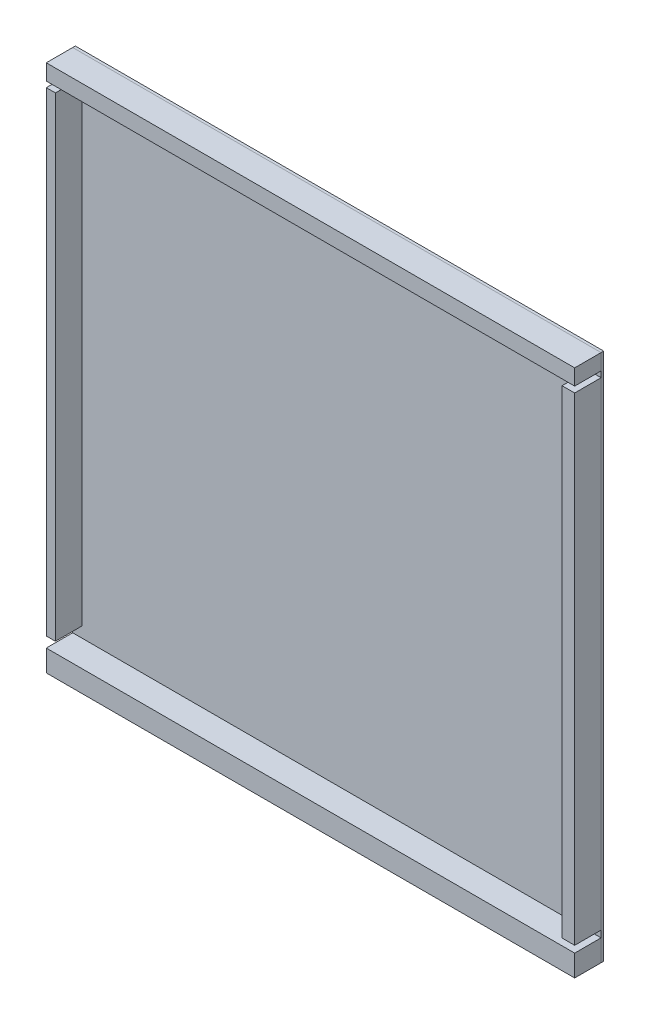
ISO-10303-21;
HEADER;
FILE_DESCRIPTION(('STEP AP214'),'2;1');
FILE_NAME('part.step','',(''),(''),'','','');
FILE_SCHEMA(('AUTOMOTIVE_DESIGN { 1 0 10303 214 1 1 1 1 }'));
ENDSEC;
DATA;
#1=APPLICATION_CONTEXT('core data for automotive mechanical design processes');
#2=APPLICATION_PROTOCOL_DEFINITION('international standard','automotive_design',2000,#1);
#3=PRODUCT_CONTEXT('',#1,'mechanical');
#4=PRODUCT('Part','Part','',(#3));
#5=PRODUCT_RELATED_PRODUCT_CATEGORY('part','',(#4));
#6=PRODUCT_DEFINITION_FORMATION('','',#4);
#7=PRODUCT_DEFINITION_CONTEXT('part definition',#1,'design');
#8=PRODUCT_DEFINITION('design','',#6,#7);
#9=PRODUCT_DEFINITION_SHAPE('','',#8);
#10=(LENGTH_UNIT() NAMED_UNIT(*) SI_UNIT(.MILLI.,.METRE.));
#11=(NAMED_UNIT(*) PLANE_ANGLE_UNIT() SI_UNIT($,.RADIAN.));
#12=(NAMED_UNIT(*) SI_UNIT($,.STERADIAN.) SOLID_ANGLE_UNIT());
#13=UNCERTAINTY_MEASURE_WITH_UNIT(LENGTH_MEASURE(1.E-05),#10,'distance_accuracy_value','');
#14=(GEOMETRIC_REPRESENTATION_CONTEXT(3) GLOBAL_UNCERTAINTY_ASSIGNED_CONTEXT((#13)) GLOBAL_UNIT_ASSIGNED_CONTEXT((#10,
#11,#12)) REPRESENTATION_CONTEXT('',''));
#15=CARTESIAN_POINT('',(0.,0.,0.));
#16=DIRECTION('',(0.,0.,1.));
#17=DIRECTION('',(1.,0.,0.));
#18=AXIS2_PLACEMENT_3D('',#15,#16,#17);
#19=CARTESIAN_POINT('',(-250.,1668.54906036764,110.));
#20=DIRECTION('',(1.,0.,0.));
#21=DIRECTION('',(0.,0.,-1.));
#22=AXIS2_PLACEMENT_3D('',#19,#20,#21);
#23=PLANE('',#22);
#24=DIRECTION('',(0.,-1.,0.));
#25=VECTOR('',#24,1.);
#26=CARTESIAN_POINT('',(-250.,1668.54906036764,10.));
#27=LINE('',#26,#25);
#28=CARTESIAN_POINT('',(-250.,1668.54906036764,10.));
#29=VERTEX_POINT('',#28);
#30=CARTESIAN_POINT('',(-250.,-128.991405169124,10.));
#31=VERTEX_POINT('',#30);
#32=EDGE_CURVE('E115',#29,#31,#27,.T.);
#33=ORIENTED_EDGE('',*,*,#32,.T.);
#34=DIRECTION('',(0.,0.,-1.));
#35=VECTOR('',#34,1.);
#36=CARTESIAN_POINT('',(-250.,-128.991405169124,110.));
#37=LINE('',#36,#35);
#38=CARTESIAN_POINT('',(-250.,-128.991405169124,110.));
#39=VERTEX_POINT('',#38);
#40=EDGE_CURVE('E12',#39,#31,#37,.T.);
#41=ORIENTED_EDGE('',*,*,#40,.F.);
#42=DIRECTION('',(0.,-1.,0.));
#43=VECTOR('',#42,1.);
#44=CARTESIAN_POINT('',(-250.,1668.54906036764,110.));
#45=LINE('',#44,#43);
#46=CARTESIAN_POINT('',(-250.,1668.54906036764,110.));
#47=VERTEX_POINT('',#46);
#48=EDGE_CURVE('E103',#47,#39,#45,.T.);
#49=ORIENTED_EDGE('',*,*,#48,.F.);
#50=DIRECTION('',(0.,0.,-1.));
#51=VECTOR('',#50,1.);
#52=CARTESIAN_POINT('',(-250.,1668.54906036764,110.));
#53=LINE('',#52,#51);
#54=EDGE_CURVE('E111',#47,#29,#53,.T.);
#55=ORIENTED_EDGE('',*,*,#54,.T.);
#56=EDGE_LOOP('',(#33,#41,#49,#55));
#57=FACE_BOUND('',#56,.T.);
#58=ADVANCED_FACE('F52',(#57),#23,.F.);
#59=CARTESIAN_POINT('',(-250.,-128.991405169124,110.));
#60=DIRECTION('',(0.,1.,0.));
#61=DIRECTION('',(0.,0.,1.));
#62=AXIS2_PLACEMENT_3D('',#59,#60,#61);
#63=PLANE('',#62);
#64=DIRECTION('',(1.,0.,0.));
#65=VECTOR('',#64,1.);
#66=CARTESIAN_POINT('',(-250.,-128.991405169124,10.));
#67=LINE('',#66,#65);
#68=CARTESIAN_POINT('',(-215.357816950501,-128.991405169124,10.));
#69=VERTEX_POINT('',#68);
#70=EDGE_CURVE('E107',#31,#69,#67,.T.);
#71=ORIENTED_EDGE('',*,*,#70,.T.);
#72=DIRECTION('',(0.,0.,-1.));
#73=VECTOR('',#72,1.);
#74=CARTESIAN_POINT('',(-215.357816950501,-128.991405169124,110.));
#75=LINE('',#74,#73);
#76=CARTESIAN_POINT('',(-215.357816950501,-128.991405169124,110.));
#77=VERTEX_POINT('',#76);
#78=EDGE_CURVE('E60',#77,#69,#75,.T.);
#79=ORIENTED_EDGE('',*,*,#78,.F.);
#80=DIRECTION('',(1.,0.,0.));
#81=VECTOR('',#80,1.);
#82=CARTESIAN_POINT('',(-250.,-128.991405169124,110.));
#83=LINE('',#82,#81);
#84=EDGE_CURVE('E98',#39,#77,#83,.T.);
#85=ORIENTED_EDGE('',*,*,#84,.F.);
#86=ORIENTED_EDGE('',*,*,#40,.T.);
#87=EDGE_LOOP('',(#71,#79,#85,#86));
#88=FACE_BOUND('',#87,.T.);
#89=ADVANCED_FACE('F106',(#88),#63,.F.);
#90=CARTESIAN_POINT('',(-215.357816950501,1668.54906036764,110.));
#91=DIRECTION('',(-1.,0.,0.));
#92=DIRECTION('',(0.,0.,1.));
#93=AXIS2_PLACEMENT_3D('',#90,#91,#92);
#94=PLANE('',#93);
#95=DIRECTION('',(0.,1.,0.));
#96=VECTOR('',#95,1.);
#97=CARTESIAN_POINT('',(-215.357816950501,1668.54906036764,10.));
#98=LINE('',#97,#96);
#99=CARTESIAN_POINT('',(-215.357816950501,1668.54906036764,10.));
#100=VERTEX_POINT('',#99);
#101=EDGE_CURVE('E85',#69,#100,#98,.T.);
#102=ORIENTED_EDGE('',*,*,#101,.T.);
#103=DIRECTION('',(0.,0.,-1.));
#104=VECTOR('',#103,1.);
#105=CARTESIAN_POINT('',(-215.357816950501,1668.54906036764,110.));
#106=LINE('',#105,#104);
#107=CARTESIAN_POINT('',(-215.357816950501,1668.54906036764,110.));
#108=VERTEX_POINT('',#107);
#109=EDGE_CURVE('E108',#108,#100,#106,.T.);
#110=ORIENTED_EDGE('',*,*,#109,.F.);
#111=DIRECTION('',(0.,1.,0.));
#112=VECTOR('',#111,1.);
#113=CARTESIAN_POINT('',(-215.357816950501,1668.54906036764,110.));
#114=LINE('',#113,#112);
#115=EDGE_CURVE('E101',#77,#108,#114,.T.);
#116=ORIENTED_EDGE('',*,*,#115,.F.);
#117=ORIENTED_EDGE('',*,*,#78,.T.);
#118=EDGE_LOOP('',(#102,#110,#116,#117));
#119=FACE_BOUND('',#118,.T.);
#120=ADVANCED_FACE('F109',(#119),#94,.F.);
#121=CARTESIAN_POINT('',(-250.,1668.54906036764,110.));
#122=DIRECTION('',(0.,-1.,0.));
#123=DIRECTION('',(0.,0.,-1.));
#124=AXIS2_PLACEMENT_3D('',#121,#122,#123);
#125=PLANE('',#124);
#126=DIRECTION('',(-1.,0.,0.));
#127=VECTOR('',#126,1.);
#128=CARTESIAN_POINT('',(-250.,1668.54906036764,10.));
#129=LINE('',#128,#127);
#130=EDGE_CURVE('E91',#100,#29,#129,.T.);
#131=ORIENTED_EDGE('',*,*,#130,.T.);
#132=ORIENTED_EDGE('',*,*,#54,.F.);
#133=DIRECTION('',(-1.,0.,0.));
#134=VECTOR('',#133,1.);
#135=CARTESIAN_POINT('',(-250.,1668.54906036764,110.));
#136=LINE('',#135,#134);
#137=EDGE_CURVE('E68',#108,#47,#136,.T.);
#138=ORIENTED_EDGE('',*,*,#137,.F.);
#139=ORIENTED_EDGE('',*,*,#109,.T.);
#140=EDGE_LOOP('',(#131,#132,#138,#139));
#141=FACE_BOUND('',#140,.T.);
#142=ADVANCED_FACE('F122',(#141),#125,.F.);
#143=CARTESIAN_POINT('',(0.,0.,110.));
#144=DIRECTION('',(0.,0.,1.));
#145=DIRECTION('',(1.,0.,0.));
#146=AXIS2_PLACEMENT_3D('',#143,#144,#145);
#147=PLANE('',#146);
#148=ORIENTED_EDGE('',*,*,#48,.T.);
#149=ORIENTED_EDGE('',*,*,#84,.T.);
#150=ORIENTED_EDGE('',*,*,#115,.T.);
#151=ORIENTED_EDGE('',*,*,#137,.T.);
#152=EDGE_LOOP('',(#148,#149,#150,#151));
#153=FACE_BOUND('',#152,.T.);
#154=ADVANCED_FACE('F99',(#153),#147,.T.);
#155=CARTESIAN_POINT('',(0.,0.,10.));
#156=DIRECTION('',(0.,0.,1.));
#157=DIRECTION('',(1.,0.,0.));
#158=AXIS2_PLACEMENT_3D('',#155,#156,#157);
#159=PLANE('',#158);
#160=ORIENTED_EDGE('',*,*,#32,.F.);
#161=ORIENTED_EDGE('',*,*,#130,.F.);
#162=ORIENTED_EDGE('',*,*,#101,.F.);
#163=ORIENTED_EDGE('',*,*,#70,.F.);
#164=EDGE_LOOP('',(#160,#161,#162,#163));
#165=FACE_BOUND('',#164,.T.);
#166=ADVANCED_FACE('F125',(#165),#159,.F.);
#167=CLOSED_SHELL('',(#58,#89,#120,#142,#154,#166));
#168=MANIFOLD_SOLID_BREP('B2',#167);
#169=CARTESIAN_POINT('',(1750.,1667.61508225097,110.));
#170=DIRECTION('',(-1.,0.,0.));
#171=DIRECTION('',(0.,0.,1.));
#172=AXIS2_PLACEMENT_3D('',#169,#170,#171);
#173=PLANE('',#172);
#174=DIRECTION('',(0.,1.,0.));
#175=VECTOR('',#174,1.);
#176=CARTESIAN_POINT('',(1750.,1667.61508225097,10.));
#177=LINE('',#176,#175);
#178=CARTESIAN_POINT('',(1750.,-142.873459851821,10.));
#179=VERTEX_POINT('',#178);
#180=CARTESIAN_POINT('',(1750.,1667.61508225097,10.));
#181=VERTEX_POINT('',#180);
#182=EDGE_CURVE('E249',#179,#181,#177,.T.);
#183=ORIENTED_EDGE('',*,*,#182,.T.);
#184=DIRECTION('',(0.,0.,-1.));
#185=VECTOR('',#184,1.);
#186=CARTESIAN_POINT('',(1750.,1667.61508225097,110.));
#187=LINE('',#186,#185);
#188=CARTESIAN_POINT('',(1750.,1667.61508225097,110.));
#189=VERTEX_POINT('',#188);
#190=EDGE_CURVE('E50',#189,#181,#187,.T.);
#191=ORIENTED_EDGE('',*,*,#190,.F.);
#192=DIRECTION('',(0.,1.,0.));
#193=VECTOR('',#192,1.);
#194=CARTESIAN_POINT('',(1750.,1667.61508225097,110.));
#195=LINE('',#194,#193);
#196=CARTESIAN_POINT('',(1750.,-142.873459851821,110.));
#197=VERTEX_POINT('',#196);
#198=EDGE_CURVE('E237',#197,#189,#195,.T.);
#199=ORIENTED_EDGE('',*,*,#198,.F.);
#200=DIRECTION('',(0.,0.,-1.));
#201=VECTOR('',#200,1.);
#202=CARTESIAN_POINT('',(1750.,-142.873459851821,110.));
#203=LINE('',#202,#201);
#204=EDGE_CURVE('E245',#197,#179,#203,.T.);
#205=ORIENTED_EDGE('',*,*,#204,.T.);
#206=EDGE_LOOP('',(#183,#191,#199,#205));
#207=FACE_BOUND('',#206,.T.);
#208=ADVANCED_FACE('F186',(#207),#173,.F.);
#209=CARTESIAN_POINT('',(1750.,1667.61508225097,110.));
#210=DIRECTION('',(0.,-1.,0.));
#211=DIRECTION('',(0.,0.,-1.));
#212=AXIS2_PLACEMENT_3D('',#209,#210,#211);
#213=PLANE('',#212);
#214=DIRECTION('',(-1.,0.,0.));
#215=VECTOR('',#214,1.);
#216=CARTESIAN_POINT('',(1750.,1667.61508225097,10.));
#217=LINE('',#216,#215);
#218=CARTESIAN_POINT('',(1702.26568186651,1667.61508225097,10.));
#219=VERTEX_POINT('',#218);
#220=EDGE_CURVE('E241',#181,#219,#217,.T.);
#221=ORIENTED_EDGE('',*,*,#220,.T.);
#222=DIRECTION('',(0.,0.,-1.));
#223=VECTOR('',#222,1.);
#224=CARTESIAN_POINT('',(1702.26568186651,1667.61508225097,110.));
#225=LINE('',#224,#223);
#226=CARTESIAN_POINT('',(1702.26568186651,1667.61508225097,110.));
#227=VERTEX_POINT('',#226);
#228=EDGE_CURVE('E194',#227,#219,#225,.T.);
#229=ORIENTED_EDGE('',*,*,#228,.F.);
#230=DIRECTION('',(-1.,0.,0.));
#231=VECTOR('',#230,1.);
#232=CARTESIAN_POINT('',(1750.,1667.61508225097,110.));
#233=LINE('',#232,#231);
#234=EDGE_CURVE('E232',#189,#227,#233,.T.);
#235=ORIENTED_EDGE('',*,*,#234,.F.);
#236=ORIENTED_EDGE('',*,*,#190,.T.);
#237=EDGE_LOOP('',(#221,#229,#235,#236));
#238=FACE_BOUND('',#237,.T.);
#239=ADVANCED_FACE('F240',(#238),#213,.F.);
#240=CARTESIAN_POINT('',(1702.26568186651,1667.61508225097,110.));
#241=DIRECTION('',(1.,0.,0.));
#242=DIRECTION('',(0.,1.,0.));
#243=AXIS2_PLACEMENT_3D('',#240,#241,#242);
#244=PLANE('',#243);
#245=DIRECTION('',(0.,-1.,0.));
#246=VECTOR('',#245,1.);
#247=CARTESIAN_POINT('',(1702.26568186651,1667.61508225097,10.));
#248=LINE('',#247,#246);
#249=CARTESIAN_POINT('',(1702.26568186651,-142.873459851821,10.));
#250=VERTEX_POINT('',#249);
#251=EDGE_CURVE('E219',#219,#250,#248,.T.);
#252=ORIENTED_EDGE('',*,*,#251,.T.);
#253=DIRECTION('',(0.,0.,-1.));
#254=VECTOR('',#253,1.);
#255=CARTESIAN_POINT('',(1702.26568186651,-142.873459851821,110.));
#256=LINE('',#255,#254);
#257=CARTESIAN_POINT('',(1702.26568186651,-142.873459851821,110.));
#258=VERTEX_POINT('',#257);
#259=EDGE_CURVE('E242',#258,#250,#256,.T.);
#260=ORIENTED_EDGE('',*,*,#259,.F.);
#261=DIRECTION('',(0.,-1.,0.));
#262=VECTOR('',#261,1.);
#263=CARTESIAN_POINT('',(1702.26568186651,1667.61508225097,110.));
#264=LINE('',#263,#262);
#265=EDGE_CURVE('E235',#227,#258,#264,.T.);
#266=ORIENTED_EDGE('',*,*,#265,.F.);
#267=ORIENTED_EDGE('',*,*,#228,.T.);
#268=EDGE_LOOP('',(#252,#260,#266,#267));
#269=FACE_BOUND('',#268,.T.);
#270=ADVANCED_FACE('F243',(#269),#244,.F.);
#271=CARTESIAN_POINT('',(1750.,-142.873459851821,110.));
#272=DIRECTION('',(0.,1.,0.));
#273=DIRECTION('',(0.,0.,1.));
#274=AXIS2_PLACEMENT_3D('',#271,#272,#273);
#275=PLANE('',#274);
#276=DIRECTION('',(1.,0.,0.));
#277=VECTOR('',#276,1.);
#278=CARTESIAN_POINT('',(1750.,-142.873459851821,10.));
#279=LINE('',#278,#277);
#280=EDGE_CURVE('E225',#250,#179,#279,.T.);
#281=ORIENTED_EDGE('',*,*,#280,.T.);
#282=ORIENTED_EDGE('',*,*,#204,.F.);
#283=DIRECTION('',(1.,0.,0.));
#284=VECTOR('',#283,1.);
#285=CARTESIAN_POINT('',(1750.,-142.873459851821,110.));
#286=LINE('',#285,#284);
#287=EDGE_CURVE('E202',#258,#197,#286,.T.);
#288=ORIENTED_EDGE('',*,*,#287,.F.);
#289=ORIENTED_EDGE('',*,*,#259,.T.);
#290=EDGE_LOOP('',(#281,#282,#288,#289));
#291=FACE_BOUND('',#290,.T.);
#292=ADVANCED_FACE('F256',(#291),#275,.F.);
#293=CARTESIAN_POINT('',(0.,0.,110.));
#294=DIRECTION('',(0.,0.,-1.));
#295=DIRECTION('',(-1.,0.,0.));
#296=AXIS2_PLACEMENT_3D('',#293,#294,#295);
#297=PLANE('',#296);
#298=ORIENTED_EDGE('',*,*,#198,.T.);
#299=ORIENTED_EDGE('',*,*,#234,.T.);
#300=ORIENTED_EDGE('',*,*,#265,.T.);
#301=ORIENTED_EDGE('',*,*,#287,.T.);
#302=EDGE_LOOP('',(#298,#299,#300,#301));
#303=FACE_BOUND('',#302,.T.);
#304=ADVANCED_FACE('F233',(#303),#297,.F.);
#305=CARTESIAN_POINT('',(0.,0.,10.));
#306=DIRECTION('',(0.,0.,-1.));
#307=DIRECTION('',(-1.,0.,0.));
#308=AXIS2_PLACEMENT_3D('',#305,#306,#307);
#309=PLANE('',#308);
#310=ORIENTED_EDGE('',*,*,#182,.F.);
#311=ORIENTED_EDGE('',*,*,#280,.F.);
#312=ORIENTED_EDGE('',*,*,#251,.F.);
#313=ORIENTED_EDGE('',*,*,#220,.F.);
#314=EDGE_LOOP('',(#310,#311,#312,#313));
#315=FACE_BOUND('',#314,.T.);
#316=ADVANCED_FACE('F259',(#315),#309,.T.);
#317=CLOSED_SHELL('',(#208,#239,#270,#292,#304,#316));
#318=MANIFOLD_SOLID_BREP('B6',#317);
#319=CARTESIAN_POINT('',(1750.,-250.,110.));
#320=DIRECTION('',(-1.,0.,0.));
#321=DIRECTION('',(0.,0.,1.));
#322=AXIS2_PLACEMENT_3D('',#319,#320,#321);
#323=PLANE('',#322);
#324=DIRECTION('',(0.,1.,0.));
#325=VECTOR('',#324,1.);
#326=CARTESIAN_POINT('',(1750.,-250.,10.));
#327=LINE('',#326,#325);
#328=CARTESIAN_POINT('',(1750.,-250.,10.));
#329=VERTEX_POINT('',#328);
#330=CARTESIAN_POINT('',(1750.,-168.414891018658,10.));
#331=VERTEX_POINT('',#330);
#332=EDGE_CURVE('E383',#329,#331,#327,.T.);
#333=ORIENTED_EDGE('',*,*,#332,.T.);
#334=DIRECTION('',(0.,0.,-1.));
#335=VECTOR('',#334,1.);
#336=CARTESIAN_POINT('',(1750.,-168.414891018658,110.));
#337=LINE('',#336,#335);
#338=CARTESIAN_POINT('',(1750.,-168.414891018658,110.));
#339=VERTEX_POINT('',#338);
#340=EDGE_CURVE('E184',#339,#331,#337,.T.);
#341=ORIENTED_EDGE('',*,*,#340,.F.);
#342=DIRECTION('',(0.,1.,0.));
#343=VECTOR('',#342,1.);
#344=CARTESIAN_POINT('',(1750.,-250.,110.));
#345=LINE('',#344,#343);
#346=CARTESIAN_POINT('',(1750.,-250.,110.));
#347=VERTEX_POINT('',#346);
#348=EDGE_CURVE('E371',#347,#339,#345,.T.);
#349=ORIENTED_EDGE('',*,*,#348,.F.);
#350=DIRECTION('',(0.,0.,-1.));
#351=VECTOR('',#350,1.);
#352=CARTESIAN_POINT('',(1750.,-250.,110.));
#353=LINE('',#352,#351);
#354=EDGE_CURVE('E379',#347,#329,#353,.T.);
#355=ORIENTED_EDGE('',*,*,#354,.T.);
#356=EDGE_LOOP('',(#333,#341,#349,#355));
#357=FACE_BOUND('',#356,.T.);
#358=ADVANCED_FACE('F320',(#357),#323,.F.);
#359=CARTESIAN_POINT('',(1750.,-168.414891018658,110.));
#360=DIRECTION('',(0.,-1.,0.));
#361=DIRECTION('',(1.,0.,0.));
#362=AXIS2_PLACEMENT_3D('',#359,#360,#361);
#363=PLANE('',#362);
#364=DIRECTION('',(-1.,0.,0.));
#365=VECTOR('',#364,1.);
#366=CARTESIAN_POINT('',(1750.,-168.414891018658,10.));
#367=LINE('',#366,#365);
#368=CARTESIAN_POINT('',(-250.,-168.414891018658,10.));
#369=VERTEX_POINT('',#368);
#370=EDGE_CURVE('E375',#331,#369,#367,.T.);
#371=ORIENTED_EDGE('',*,*,#370,.T.);
#372=DIRECTION('',(0.,0.,-1.));
#373=VECTOR('',#372,1.);
#374=CARTESIAN_POINT('',(-250.,-168.414891018658,110.));
#375=LINE('',#374,#373);
#376=CARTESIAN_POINT('',(-250.,-168.414891018658,110.));
#377=VERTEX_POINT('',#376);
#378=EDGE_CURVE('E328',#377,#369,#375,.T.);
#379=ORIENTED_EDGE('',*,*,#378,.F.);
#380=DIRECTION('',(-1.,0.,0.));
#381=VECTOR('',#380,1.);
#382=CARTESIAN_POINT('',(1750.,-168.414891018658,110.));
#383=LINE('',#382,#381);
#384=EDGE_CURVE('E366',#339,#377,#383,.T.);
#385=ORIENTED_EDGE('',*,*,#384,.F.);
#386=ORIENTED_EDGE('',*,*,#340,.T.);
#387=EDGE_LOOP('',(#371,#379,#385,#386));
#388=FACE_BOUND('',#387,.T.);
#389=ADVANCED_FACE('F374',(#388),#363,.F.);
#390=CARTESIAN_POINT('',(-250.,-250.,110.));
#391=DIRECTION('',(1.,0.,0.));
#392=DIRECTION('',(0.,1.,0.));
#393=AXIS2_PLACEMENT_3D('',#390,#391,#392);
#394=PLANE('',#393);
#395=DIRECTION('',(0.,-1.,0.));
#396=VECTOR('',#395,1.);
#397=CARTESIAN_POINT('',(-250.,-250.,10.));
#398=LINE('',#397,#396);
#399=CARTESIAN_POINT('',(-250.,-250.,10.));
#400=VERTEX_POINT('',#399);
#401=EDGE_CURVE('E353',#369,#400,#398,.T.);
#402=ORIENTED_EDGE('',*,*,#401,.T.);
#403=DIRECTION('',(0.,0.,-1.));
#404=VECTOR('',#403,1.);
#405=CARTESIAN_POINT('',(-250.,-250.,110.));
#406=LINE('',#405,#404);
#407=CARTESIAN_POINT('',(-250.,-250.,110.));
#408=VERTEX_POINT('',#407);
#409=EDGE_CURVE('E376',#408,#400,#406,.T.);
#410=ORIENTED_EDGE('',*,*,#409,.F.);
#411=DIRECTION('',(0.,-1.,0.));
#412=VECTOR('',#411,1.);
#413=CARTESIAN_POINT('',(-250.,-250.,110.));
#414=LINE('',#413,#412);
#415=EDGE_CURVE('E369',#377,#408,#414,.T.);
#416=ORIENTED_EDGE('',*,*,#415,.F.);
#417=ORIENTED_EDGE('',*,*,#378,.T.);
#418=EDGE_LOOP('',(#402,#410,#416,#417));
#419=FACE_BOUND('',#418,.T.);
#420=ADVANCED_FACE('F377',(#419),#394,.F.);
#421=CARTESIAN_POINT('',(1750.,-250.,110.));
#422=DIRECTION('',(0.,1.,0.));
#423=DIRECTION('',(-1.,0.,0.));
#424=AXIS2_PLACEMENT_3D('',#421,#422,#423);
#425=PLANE('',#424);
#426=DIRECTION('',(1.,0.,0.));
#427=VECTOR('',#426,1.);
#428=CARTESIAN_POINT('',(1750.,-250.,10.));
#429=LINE('',#428,#427);
#430=EDGE_CURVE('E359',#400,#329,#429,.T.);
#431=ORIENTED_EDGE('',*,*,#430,.T.);
#432=ORIENTED_EDGE('',*,*,#354,.F.);
#433=DIRECTION('',(1.,0.,0.));
#434=VECTOR('',#433,1.);
#435=CARTESIAN_POINT('',(1750.,-250.,110.));
#436=LINE('',#435,#434);
#437=EDGE_CURVE('E336',#408,#347,#436,.T.);
#438=ORIENTED_EDGE('',*,*,#437,.F.);
#439=ORIENTED_EDGE('',*,*,#409,.T.);
#440=EDGE_LOOP('',(#431,#432,#438,#439));
#441=FACE_BOUND('',#440,.T.);
#442=ADVANCED_FACE('F390',(#441),#425,.F.);
#443=CARTESIAN_POINT('',(0.,0.,110.));
#444=DIRECTION('',(0.,0.,1.));
#445=DIRECTION('',(1.,0.,0.));
#446=AXIS2_PLACEMENT_3D('',#443,#444,#445);
#447=PLANE('',#446);
#448=ORIENTED_EDGE('',*,*,#348,.T.);
#449=ORIENTED_EDGE('',*,*,#384,.T.);
#450=ORIENTED_EDGE('',*,*,#415,.T.);
#451=ORIENTED_EDGE('',*,*,#437,.T.);
#452=EDGE_LOOP('',(#448,#449,#450,#451));
#453=FACE_BOUND('',#452,.T.);
#454=ADVANCED_FACE('F367',(#453),#447,.T.);
#455=CARTESIAN_POINT('',(0.,0.,10.));
#456=DIRECTION('',(0.,0.,1.));
#457=DIRECTION('',(1.,0.,0.));
#458=AXIS2_PLACEMENT_3D('',#455,#456,#457);
#459=PLANE('',#458);
#460=ORIENTED_EDGE('',*,*,#332,.F.);
#461=ORIENTED_EDGE('',*,*,#430,.F.);
#462=ORIENTED_EDGE('',*,*,#401,.F.);
#463=ORIENTED_EDGE('',*,*,#370,.F.);
#464=EDGE_LOOP('',(#460,#461,#462,#463));
#465=FACE_BOUND('',#464,.T.);
#466=ADVANCED_FACE('F393',(#465),#459,.F.);
#467=CLOSED_SHELL('',(#358,#389,#420,#442,#454,#466));
#468=MANIFOLD_SOLID_BREP('B44',#467);
#469=CARTESIAN_POINT('',(-250.,1750.,110.));
#470=DIRECTION('',(1.,0.,0.));
#471=DIRECTION('',(0.,0.,-1.));
#472=AXIS2_PLACEMENT_3D('',#469,#470,#471);
#473=PLANE('',#472);
#474=DIRECTION('',(0.,-1.,0.));
#475=VECTOR('',#474,1.);
#476=CARTESIAN_POINT('',(-250.,1750.,10.));
#477=LINE('',#476,#475);
#478=CARTESIAN_POINT('',(-250.,1750.,10.));
#479=VERTEX_POINT('',#478);
#480=CARTESIAN_POINT('',(-250.,1690.1337543449,10.));
#481=VERTEX_POINT('',#480);
#482=EDGE_CURVE('E517',#479,#481,#477,.T.);
#483=ORIENTED_EDGE('',*,*,#482,.T.);
#484=DIRECTION('',(0.,0.,-1.));
#485=VECTOR('',#484,1.);
#486=CARTESIAN_POINT('',(-250.,1690.1337543449,110.));
#487=LINE('',#486,#485);
#488=CARTESIAN_POINT('',(-250.,1690.1337543449,110.));
#489=VERTEX_POINT('',#488);
#490=EDGE_CURVE('E318',#489,#481,#487,.T.);
#491=ORIENTED_EDGE('',*,*,#490,.F.);
#492=DIRECTION('',(0.,-1.,0.));
#493=VECTOR('',#492,1.);
#494=CARTESIAN_POINT('',(-250.,1750.,110.));
#495=LINE('',#494,#493);
#496=CARTESIAN_POINT('',(-250.,1750.,110.));
#497=VERTEX_POINT('',#496);
#498=EDGE_CURVE('E505',#497,#489,#495,.T.);
#499=ORIENTED_EDGE('',*,*,#498,.F.);
#500=DIRECTION('',(0.,0.,-1.));
#501=VECTOR('',#500,1.);
#502=CARTESIAN_POINT('',(-250.,1750.,110.));
#503=LINE('',#502,#501);
#504=EDGE_CURVE('E513',#497,#479,#503,.T.);
#505=ORIENTED_EDGE('',*,*,#504,.T.);
#506=EDGE_LOOP('',(#483,#491,#499,#505));
#507=FACE_BOUND('',#506,.T.);
#508=ADVANCED_FACE('F454',(#507),#473,.F.);
#509=CARTESIAN_POINT('',(-250.,1690.1337543449,110.));
#510=DIRECTION('',(0.,1.,0.));
#511=DIRECTION('',(0.,0.,1.));
#512=AXIS2_PLACEMENT_3D('',#509,#510,#511);
#513=PLANE('',#512);
#514=DIRECTION('',(1.,0.,0.));
#515=VECTOR('',#514,1.);
#516=CARTESIAN_POINT('',(-250.,1690.1337543449,10.));
#517=LINE('',#516,#515);
#518=CARTESIAN_POINT('',(1750.,1690.1337543449,10.));
#519=VERTEX_POINT('',#518);
#520=EDGE_CURVE('E509',#481,#519,#517,.T.);
#521=ORIENTED_EDGE('',*,*,#520,.T.);
#522=DIRECTION('',(0.,0.,-1.));
#523=VECTOR('',#522,1.);
#524=CARTESIAN_POINT('',(1750.,1690.1337543449,110.));
#525=LINE('',#524,#523);
#526=CARTESIAN_POINT('',(1750.,1690.1337543449,110.));
#527=VERTEX_POINT('',#526);
#528=EDGE_CURVE('E462',#527,#519,#525,.T.);
#529=ORIENTED_EDGE('',*,*,#528,.F.);
#530=DIRECTION('',(1.,0.,0.));
#531=VECTOR('',#530,1.);
#532=CARTESIAN_POINT('',(-250.,1690.1337543449,110.));
#533=LINE('',#532,#531);
#534=EDGE_CURVE('E500',#489,#527,#533,.T.);
#535=ORIENTED_EDGE('',*,*,#534,.F.);
#536=ORIENTED_EDGE('',*,*,#490,.T.);
#537=EDGE_LOOP('',(#521,#529,#535,#536));
#538=FACE_BOUND('',#537,.T.);
#539=ADVANCED_FACE('F508',(#538),#513,.F.);
#540=CARTESIAN_POINT('',(1750.,1750.,110.));
#541=DIRECTION('',(-1.,0.,0.));
#542=DIRECTION('',(0.,-1.,0.));
#543=AXIS2_PLACEMENT_3D('',#540,#541,#542);
#544=PLANE('',#543);
#545=DIRECTION('',(0.,1.,0.));
#546=VECTOR('',#545,1.);
#547=CARTESIAN_POINT('',(1750.,1750.,10.));
#548=LINE('',#547,#546);
#549=CARTESIAN_POINT('',(1750.,1750.,10.));
#550=VERTEX_POINT('',#549);
#551=EDGE_CURVE('E487',#519,#550,#548,.T.);
#552=ORIENTED_EDGE('',*,*,#551,.T.);
#553=DIRECTION('',(0.,0.,-1.));
#554=VECTOR('',#553,1.);
#555=CARTESIAN_POINT('',(1750.,1750.,110.));
#556=LINE('',#555,#554);
#557=CARTESIAN_POINT('',(1750.,1750.,110.));
#558=VERTEX_POINT('',#557);
#559=EDGE_CURVE('E510',#558,#550,#556,.T.);
#560=ORIENTED_EDGE('',*,*,#559,.F.);
#561=DIRECTION('',(0.,1.,0.));
#562=VECTOR('',#561,1.);
#563=CARTESIAN_POINT('',(1750.,1750.,110.));
#564=LINE('',#563,#562);
#565=EDGE_CURVE('E503',#527,#558,#564,.T.);
#566=ORIENTED_EDGE('',*,*,#565,.F.);
#567=ORIENTED_EDGE('',*,*,#528,.T.);
#568=EDGE_LOOP('',(#552,#560,#566,#567));
#569=FACE_BOUND('',#568,.T.);
#570=ADVANCED_FACE('F511',(#569),#544,.F.);
#571=CARTESIAN_POINT('',(-250.,1750.,110.));
#572=DIRECTION('',(0.,-1.,0.));
#573=DIRECTION('',(0.,0.,-1.));
#574=AXIS2_PLACEMENT_3D('',#571,#572,#573);
#575=PLANE('',#574);
#576=DIRECTION('',(-1.,0.,0.));
#577=VECTOR('',#576,1.);
#578=CARTESIAN_POINT('',(-250.,1750.,10.));
#579=LINE('',#578,#577);
#580=EDGE_CURVE('E493',#550,#479,#579,.T.);
#581=ORIENTED_EDGE('',*,*,#580,.T.);
#582=ORIENTED_EDGE('',*,*,#504,.F.);
#583=DIRECTION('',(-1.,0.,0.));
#584=VECTOR('',#583,1.);
#585=CARTESIAN_POINT('',(-250.,1750.,110.));
#586=LINE('',#585,#584);
#587=EDGE_CURVE('E470',#558,#497,#586,.T.);
#588=ORIENTED_EDGE('',*,*,#587,.F.);
#589=ORIENTED_EDGE('',*,*,#559,.T.);
#590=EDGE_LOOP('',(#581,#582,#588,#589));
#591=FACE_BOUND('',#590,.T.);
#592=ADVANCED_FACE('F524',(#591),#575,.F.);
#593=CARTESIAN_POINT('',(0.,0.,110.));
#594=DIRECTION('',(0.,0.,1.));
#595=DIRECTION('',(1.,0.,0.));
#596=AXIS2_PLACEMENT_3D('',#593,#594,#595);
#597=PLANE('',#596);
#598=ORIENTED_EDGE('',*,*,#498,.T.);
#599=ORIENTED_EDGE('',*,*,#534,.T.);
#600=ORIENTED_EDGE('',*,*,#565,.T.);
#601=ORIENTED_EDGE('',*,*,#587,.T.);
#602=EDGE_LOOP('',(#598,#599,#600,#601));
#603=FACE_BOUND('',#602,.T.);
#604=ADVANCED_FACE('F501',(#603),#597,.T.);
#605=CARTESIAN_POINT('',(0.,0.,10.));
#606=DIRECTION('',(0.,0.,1.));
#607=DIRECTION('',(1.,0.,0.));
#608=AXIS2_PLACEMENT_3D('',#605,#606,#607);
#609=PLANE('',#608);
#610=ORIENTED_EDGE('',*,*,#482,.F.);
#611=ORIENTED_EDGE('',*,*,#580,.F.);
#612=ORIENTED_EDGE('',*,*,#551,.F.);
#613=ORIENTED_EDGE('',*,*,#520,.F.);
#614=EDGE_LOOP('',(#610,#611,#612,#613));
#615=FACE_BOUND('',#614,.T.);
#616=ADVANCED_FACE('F527',(#615),#609,.F.);
#617=CLOSED_SHELL('',(#508,#539,#570,#592,#604,#616));
#618=MANIFOLD_SOLID_BREP('B178',#617);
#619=CARTESIAN_POINT('',(0.,0.,0.));
#620=DIRECTION('',(0.,0.,1.));
#621=DIRECTION('',(1.,0.,0.));
#622=AXIS2_PLACEMENT_3D('',#619,#620,#621);
#623=PLANE('',#622);
#624=DIRECTION('',(0.,1.,0.));
#625=VECTOR('',#624,1.);
#626=CARTESIAN_POINT('',(-250.,1750.,0.));
#627=LINE('',#626,#625);
#628=CARTESIAN_POINT('',(-250.,-250.,-1.13686837721616E-10));
#629=VERTEX_POINT('',#628);
#630=CARTESIAN_POINT('',(-250.,1750.,-1.13686837721616E-10));
#631=VERTEX_POINT('',#630);
#632=EDGE_CURVE('E633',#629,#631,#627,.T.);
#633=ORIENTED_EDGE('',*,*,#632,.T.);
#634=DIRECTION('',(-1.,0.,0.));
#635=VECTOR('',#634,1.);
#636=CARTESIAN_POINT('',(-250.,1750.,0.));
#637=LINE('',#636,#635);
#638=CARTESIAN_POINT('',(1750.,1750.,-1.13686837721616E-10));
#639=VERTEX_POINT('',#638);
#640=EDGE_CURVE('E648',#639,#631,#637,.T.);
#641=ORIENTED_EDGE('',*,*,#640,.F.);
#642=DIRECTION('',(0.,1.,0.));
#643=VECTOR('',#642,1.);
#644=CARTESIAN_POINT('',(1750.,1750.,0.));
#645=LINE('',#644,#643);
#646=CARTESIAN_POINT('',(1750.,-250.,-1.13686837721616E-10));
#647=VERTEX_POINT('',#646);
#648=EDGE_CURVE('E634',#647,#639,#645,.T.);
#649=ORIENTED_EDGE('',*,*,#648,.F.);
#650=DIRECTION('',(1.,0.,0.));
#651=VECTOR('',#650,1.);
#652=CARTESIAN_POINT('',(-250.,-250.,0.));
#653=LINE('',#652,#651);
#654=EDGE_CURVE('E631',#629,#647,#653,.T.);
#655=ORIENTED_EDGE('',*,*,#654,.F.);
#656=EDGE_LOOP('',(#633,#641,#649,#655));
#657=FACE_BOUND('',#656,.T.);
#658=ADVANCED_FACE('F587',(#657),#623,.F.);
#659=CARTESIAN_POINT('',(1750.,1750.,-500000.));
#660=DIRECTION('',(1.,0.,0.));
#661=DIRECTION('',(0.,1.,0.));
#662=AXIS2_PLACEMENT_3D('',#659,#660,#661);
#663=PLANE('',#662);
#664=DIRECTION('',(0.,0.,1.));
#665=VECTOR('',#664,1.);
#666=CARTESIAN_POINT('',(1750.,-250.,-500000.));
#667=LINE('',#666,#665);
#668=CARTESIAN_POINT('',(1750.,-250.,10.));
#669=VERTEX_POINT('',#668);
#670=EDGE_CURVE('E647',#647,#669,#667,.T.);
#671=ORIENTED_EDGE('',*,*,#670,.F.);
#672=ORIENTED_EDGE('',*,*,#648,.T.);
#673=DIRECTION('',(0.,0.,1.));
#674=VECTOR('',#673,1.);
#675=CARTESIAN_POINT('',(1750.,1750.,-500000.));
#676=LINE('',#675,#674);
#677=CARTESIAN_POINT('',(1750.,1750.,10.));
#678=VERTEX_POINT('',#677);
#679=EDGE_CURVE('E611',#639,#678,#676,.T.);
#680=ORIENTED_EDGE('',*,*,#679,.T.);
#681=DIRECTION('',(0.,1.,0.));
#682=VECTOR('',#681,1.);
#683=CARTESIAN_POINT('',(1750.,1750.,10.));
#684=LINE('',#683,#682);
#685=EDGE_CURVE('E653',#669,#678,#684,.T.);
#686=ORIENTED_EDGE('',*,*,#685,.F.);
#687=EDGE_LOOP('',(#671,#672,#680,#686));
#688=FACE_BOUND('',#687,.T.);
#689=ADVANCED_FACE('F660',(#688),#663,.T.);
#690=CARTESIAN_POINT('',(0.,0.,10.));
#691=DIRECTION('',(0.,0.,1.));
#692=DIRECTION('',(1.,0.,0.));
#693=AXIS2_PLACEMENT_3D('',#690,#691,#692);
#694=PLANE('',#693);
#695=DIRECTION('',(0.,-1.,0.));
#696=VECTOR('',#695,1.);
#697=CARTESIAN_POINT('',(-250.,1750.,10.));
#698=LINE('',#697,#696);
#699=CARTESIAN_POINT('',(-250.,1750.,10.));
#700=VERTEX_POINT('',#699);
#701=CARTESIAN_POINT('',(-250.,-250.,10.));
#702=VERTEX_POINT('',#701);
#703=EDGE_CURVE('E452',#700,#702,#698,.T.);
#704=ORIENTED_EDGE('',*,*,#703,.T.);
#705=DIRECTION('',(1.,0.,0.));
#706=VECTOR('',#705,1.);
#707=CARTESIAN_POINT('',(-250.,-250.,10.));
#708=LINE('',#707,#706);
#709=EDGE_CURVE('E596',#702,#669,#708,.T.);
#710=ORIENTED_EDGE('',*,*,#709,.T.);
#711=ORIENTED_EDGE('',*,*,#685,.T.);
#712=DIRECTION('',(-1.,0.,0.));
#713=VECTOR('',#712,1.);
#714=CARTESIAN_POINT('',(-250.,1750.,10.));
#715=LINE('',#714,#713);
#716=EDGE_CURVE('E652',#678,#700,#715,.T.);
#717=ORIENTED_EDGE('',*,*,#716,.T.);
#718=EDGE_LOOP('',(#704,#710,#711,#717));
#719=FACE_BOUND('',#718,.T.);
#720=ADVANCED_FACE('F661',(#719),#694,.T.);
#721=CARTESIAN_POINT('',(-250.,1750.,-500000.));
#722=DIRECTION('',(0.,1.,0.));
#723=DIRECTION('',(0.,0.,1.));
#724=AXIS2_PLACEMENT_3D('',#721,#722,#723);
#725=PLANE('',#724);
#726=ORIENTED_EDGE('',*,*,#679,.F.);
#727=ORIENTED_EDGE('',*,*,#640,.T.);
#728=DIRECTION('',(0.,0.,1.));
#729=VECTOR('',#728,1.);
#730=CARTESIAN_POINT('',(-250.,1750.,-500000.));
#731=LINE('',#730,#729);
#732=EDGE_CURVE('E591',#631,#700,#731,.T.);
#733=ORIENTED_EDGE('',*,*,#732,.T.);
#734=ORIENTED_EDGE('',*,*,#716,.F.);
#735=EDGE_LOOP('',(#726,#727,#733,#734));
#736=FACE_BOUND('',#735,.T.);
#737=ADVANCED_FACE('F589',(#736),#725,.T.);
#738=CARTESIAN_POINT('',(-250.,-250.,-500000.));
#739=DIRECTION('',(0.,-1.,0.));
#740=DIRECTION('',(1.,0.,0.));
#741=AXIS2_PLACEMENT_3D('',#738,#739,#740);
#742=PLANE('',#741);
#743=DIRECTION('',(0.,0.,1.));
#744=VECTOR('',#743,1.);
#745=CARTESIAN_POINT('',(-250.,-250.,-500000.));
#746=LINE('',#745,#744);
#747=EDGE_CURVE('E642',#629,#702,#746,.T.);
#748=ORIENTED_EDGE('',*,*,#747,.F.);
#749=ORIENTED_EDGE('',*,*,#654,.T.);
#750=ORIENTED_EDGE('',*,*,#670,.T.);
#751=ORIENTED_EDGE('',*,*,#709,.F.);
#752=EDGE_LOOP('',(#748,#749,#750,#751));
#753=FACE_BOUND('',#752,.T.);
#754=ADVANCED_FACE('F645',(#753),#742,.T.);
#755=CARTESIAN_POINT('',(-250.,1750.,-500000.));
#756=DIRECTION('',(-1.,0.,0.));
#757=DIRECTION('',(0.,-1.,0.));
#758=AXIS2_PLACEMENT_3D('',#755,#756,#757);
#759=PLANE('',#758);
#760=ORIENTED_EDGE('',*,*,#632,.F.);
#761=ORIENTED_EDGE('',*,*,#747,.T.);
#762=ORIENTED_EDGE('',*,*,#703,.F.);
#763=ORIENTED_EDGE('',*,*,#732,.F.);
#764=EDGE_LOOP('',(#760,#761,#762,#763));
#765=FACE_BOUND('',#764,.T.);
#766=ADVANCED_FACE('F640',(#765),#759,.T.);
#767=CLOSED_SHELL('',(#658,#689,#720,#737,#754,#766));
#768=MANIFOLD_SOLID_BREP('B312',#767);
#769=CARTESIAN_POINT('',(-250.,1750.,10.));
#770=DIRECTION('',(1.,0.,0.));
#771=DIRECTION('',(0.,1.,0.));
#772=AXIS2_PLACEMENT_3D('',#769,#770,#771);
#773=PLANE('',#772);
#774=DIRECTION('',(0.,-1.,0.));
#775=VECTOR('',#774,1.);
#776=CARTESIAN_POINT('',(-250.,1750.,0.));
#777=LINE('',#776,#775);
#778=CARTESIAN_POINT('',(-250.,1750.,0.));
#779=VERTEX_POINT('',#778);
#780=CARTESIAN_POINT('',(-250.,-250.,0.));
#781=VERTEX_POINT('',#780);
#782=EDGE_CURVE('E773',#779,#781,#777,.T.);
#783=ORIENTED_EDGE('',*,*,#782,.T.);
#784=DIRECTION('',(0.,0.,-1.));
#785=VECTOR('',#784,1.);
#786=CARTESIAN_POINT('',(-250.,-250.,10.));
#787=LINE('',#786,#785);
#788=CARTESIAN_POINT('',(-250.,-250.,10.));
#789=VERTEX_POINT('',#788);
#790=EDGE_CURVE('E585',#789,#781,#787,.T.);
#791=ORIENTED_EDGE('',*,*,#790,.F.);
#792=DIRECTION('',(0.,-1.,0.));
#793=VECTOR('',#792,1.);
#794=CARTESIAN_POINT('',(-250.,1750.,10.));
#795=LINE('',#794,#793);
#796=CARTESIAN_POINT('',(-250.,1750.,10.));
#797=VERTEX_POINT('',#796);
#798=EDGE_CURVE('E761',#797,#789,#795,.T.);
#799=ORIENTED_EDGE('',*,*,#798,.F.);
#800=DIRECTION('',(0.,0.,-1.));
#801=VECTOR('',#800,1.);
#802=CARTESIAN_POINT('',(-250.,1750.,10.));
#803=LINE('',#802,#801);
#804=EDGE_CURVE('E769',#797,#779,#803,.T.);
#805=ORIENTED_EDGE('',*,*,#804,.T.);
#806=EDGE_LOOP('',(#783,#791,#799,#805));
#807=FACE_BOUND('',#806,.T.);
#808=ADVANCED_FACE('F710',(#807),#773,.F.);
#809=CARTESIAN_POINT('',(-250.,-250.,10.));
#810=DIRECTION('',(0.,1.,0.));
#811=DIRECTION('',(-1.,0.,0.));
#812=AXIS2_PLACEMENT_3D('',#809,#810,#811);
#813=PLANE('',#812);
#814=DIRECTION('',(1.,0.,0.));
#815=VECTOR('',#814,1.);
#816=CARTESIAN_POINT('',(-250.,-250.,0.));
#817=LINE('',#816,#815);
#818=CARTESIAN_POINT('',(1750.,-250.,0.));
#819=VERTEX_POINT('',#818);
#820=EDGE_CURVE('E765',#781,#819,#817,.T.);
#821=ORIENTED_EDGE('',*,*,#820,.T.);
#822=DIRECTION('',(0.,0.,-1.));
#823=VECTOR('',#822,1.);
#824=CARTESIAN_POINT('',(1750.,-250.,10.));
#825=LINE('',#824,#823);
#826=CARTESIAN_POINT('',(1750.,-250.,10.));
#827=VERTEX_POINT('',#826);
#828=EDGE_CURVE('E718',#827,#819,#825,.T.);
#829=ORIENTED_EDGE('',*,*,#828,.F.);
#830=DIRECTION('',(1.,0.,0.));
#831=VECTOR('',#830,1.);
#832=CARTESIAN_POINT('',(-250.,-250.,10.));
#833=LINE('',#832,#831);
#834=EDGE_CURVE('E756',#789,#827,#833,.T.);
#835=ORIENTED_EDGE('',*,*,#834,.F.);
#836=ORIENTED_EDGE('',*,*,#790,.T.);
#837=EDGE_LOOP('',(#821,#829,#835,#836));
#838=FACE_BOUND('',#837,.T.);
#839=ADVANCED_FACE('F764',(#838),#813,.F.);
#840=CARTESIAN_POINT('',(1750.,1750.,10.));
#841=DIRECTION('',(-1.,0.,0.));
#842=DIRECTION('',(0.,0.,1.));
#843=AXIS2_PLACEMENT_3D('',#840,#841,#842);
#844=PLANE('',#843);
#845=DIRECTION('',(0.,1.,0.));
#846=VECTOR('',#845,1.);
#847=CARTESIAN_POINT('',(1750.,1750.,0.));
#848=LINE('',#847,#846);
#849=CARTESIAN_POINT('',(1750.,1750.,0.));
#850=VERTEX_POINT('',#849);
#851=EDGE_CURVE('E743',#819,#850,#848,.T.);
#852=ORIENTED_EDGE('',*,*,#851,.T.);
#853=DIRECTION('',(0.,0.,-1.));
#854=VECTOR('',#853,1.);
#855=CARTESIAN_POINT('',(1750.,1750.,10.));
#856=LINE('',#855,#854);
#857=CARTESIAN_POINT('',(1750.,1750.,10.));
#858=VERTEX_POINT('',#857);
#859=EDGE_CURVE('E766',#858,#850,#856,.T.);
#860=ORIENTED_EDGE('',*,*,#859,.F.);
#861=DIRECTION('',(0.,1.,0.));
#862=VECTOR('',#861,1.);
#863=CARTESIAN_POINT('',(1750.,1750.,10.));
#864=LINE('',#863,#862);
#865=EDGE_CURVE('E759',#827,#858,#864,.T.);
#866=ORIENTED_EDGE('',*,*,#865,.F.);
#867=ORIENTED_EDGE('',*,*,#828,.T.);
#868=EDGE_LOOP('',(#852,#860,#866,#867));
#869=FACE_BOUND('',#868,.T.);
#870=ADVANCED_FACE('F767',(#869),#844,.F.);
#871=CARTESIAN_POINT('',(-250.,1750.,10.));
#872=DIRECTION('',(0.,-1.,0.));
#873=DIRECTION('',(0.,0.,-1.));
#874=AXIS2_PLACEMENT_3D('',#871,#872,#873);
#875=PLANE('',#874);
#876=DIRECTION('',(-1.,0.,0.));
#877=VECTOR('',#876,1.);
#878=CARTESIAN_POINT('',(-250.,1750.,0.));
#879=LINE('',#878,#877);
#880=EDGE_CURVE('E749',#850,#779,#879,.T.);
#881=ORIENTED_EDGE('',*,*,#880,.T.);
#882=ORIENTED_EDGE('',*,*,#804,.F.);
#883=DIRECTION('',(-1.,0.,0.));
#884=VECTOR('',#883,1.);
#885=CARTESIAN_POINT('',(-250.,1750.,10.));
#886=LINE('',#885,#884);
#887=EDGE_CURVE('E726',#858,#797,#886,.T.);
#888=ORIENTED_EDGE('',*,*,#887,.F.);
#889=ORIENTED_EDGE('',*,*,#859,.T.);
#890=EDGE_LOOP('',(#881,#882,#888,#889));
#891=FACE_BOUND('',#890,.T.);
#892=ADVANCED_FACE('F780',(#891),#875,.F.);
#893=CARTESIAN_POINT('',(0.,0.,10.));
#894=DIRECTION('',(0.,0.,1.));
#895=DIRECTION('',(1.,0.,0.));
#896=AXIS2_PLACEMENT_3D('',#893,#894,#895);
#897=PLANE('',#896);
#898=ORIENTED_EDGE('',*,*,#798,.T.);
#899=ORIENTED_EDGE('',*,*,#834,.T.);
#900=ORIENTED_EDGE('',*,*,#865,.T.);
#901=ORIENTED_EDGE('',*,*,#887,.T.);
#902=EDGE_LOOP('',(#898,#899,#900,#901));
#903=FACE_BOUND('',#902,.T.);
#904=ADVANCED_FACE('F757',(#903),#897,.T.);
#905=CARTESIAN_POINT('',(0.,0.,0.));
#906=DIRECTION('',(0.,0.,1.));
#907=DIRECTION('',(1.,0.,0.));
#908=AXIS2_PLACEMENT_3D('',#905,#906,#907);
#909=PLANE('',#908);
#910=ORIENTED_EDGE('',*,*,#782,.F.);
#911=ORIENTED_EDGE('',*,*,#880,.F.);
#912=ORIENTED_EDGE('',*,*,#851,.F.);
#913=ORIENTED_EDGE('',*,*,#820,.F.);
#914=EDGE_LOOP('',(#910,#911,#912,#913));
#915=FACE_BOUND('',#914,.T.);
#916=ADVANCED_FACE('F783',(#915),#909,.F.);
#917=CLOSED_SHELL('',(#808,#839,#870,#892,#904,#916));
#918=MANIFOLD_SOLID_BREP('B446',#917);
#919=ADVANCED_BREP_SHAPE_REPRESENTATION('',(#18,#168,#318,#468,#618,#768,#918),#14);
#920=SHAPE_DEFINITION_REPRESENTATION(#9,#919);
ENDSEC;
END-ISO-10303-21;
